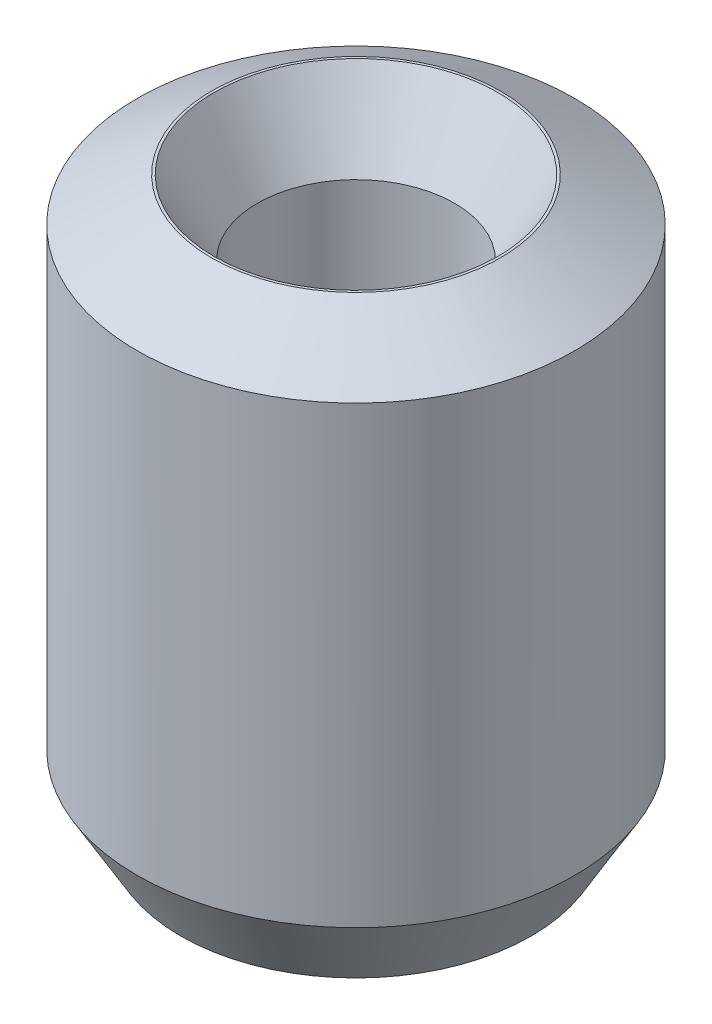
ISO-10303-21;
HEADER;
FILE_DESCRIPTION(('STEP AP214'),'2;1');
FILE_NAME('part.step','',(''),(''),'','','');
FILE_SCHEMA(('AUTOMOTIVE_DESIGN { 1 0 10303 214 1 1 1 1 }'));
ENDSEC;
DATA;
#1=APPLICATION_CONTEXT('core data for automotive mechanical design processes');
#2=APPLICATION_PROTOCOL_DEFINITION('international standard','automotive_design',2000,#1);
#3=PRODUCT_CONTEXT('',#1,'mechanical');
#4=PRODUCT('Part','Part','',(#3));
#5=PRODUCT_RELATED_PRODUCT_CATEGORY('part','',(#4));
#6=PRODUCT_DEFINITION_FORMATION('','',#4);
#7=PRODUCT_DEFINITION_CONTEXT('part definition',#1,'design');
#8=PRODUCT_DEFINITION('design','',#6,#7);
#9=PRODUCT_DEFINITION_SHAPE('','',#8);
#10=(LENGTH_UNIT() NAMED_UNIT(*) SI_UNIT(.MILLI.,.METRE.));
#11=(NAMED_UNIT(*) PLANE_ANGLE_UNIT() SI_UNIT($,.RADIAN.));
#12=(NAMED_UNIT(*) SI_UNIT($,.STERADIAN.) SOLID_ANGLE_UNIT());
#13=UNCERTAINTY_MEASURE_WITH_UNIT(LENGTH_MEASURE(1.E-05),#10,'distance_accuracy_value','');
#14=(GEOMETRIC_REPRESENTATION_CONTEXT(3) GLOBAL_UNCERTAINTY_ASSIGNED_CONTEXT((#13)) GLOBAL_UNIT_ASSIGNED_CONTEXT((#10,
#11,#12)) REPRESENTATION_CONTEXT('',''));
#15=CARTESIAN_POINT('',(0.,0.,0.));
#16=DIRECTION('',(0.,0.,1.));
#17=DIRECTION('',(1.,0.,0.));
#18=AXIS2_PLACEMENT_3D('',#15,#16,#17);
#19=CARTESIAN_POINT('',(0.,52.3049852284632,0.));
#20=DIRECTION('',(0.,-1.,0.));
#21=DIRECTION('',(0.,0.,-1.));
#22=AXIS2_PLACEMENT_3D('',#19,#20,#21);
#23=CYLINDRICAL_SURFACE('',#22,20.);
#24=CARTESIAN_POINT('',(0.,6.78475319766107,0.));
#25=DIRECTION('',(0.,1.,0.));
#26=DIRECTION('',(0.,0.,1.));
#27=AXIS2_PLACEMENT_3D('',#24,#25,#26);
#28=CIRCLE('',#27,20.);
#29=CARTESIAN_POINT('',(0.,6.78475319766107,-20.));
#30=VERTEX_POINT('',#29);
#31=EDGE_CURVE('E10',#30,#30,#28,.T.);
#32=CARTESIAN_POINT('',(0.,48.3359332587798,0.));
#33=DIRECTION('',(0.,1.,0.));
#34=DIRECTION('',(0.,0.,1.));
#35=AXIS2_PLACEMENT_3D('',#32,#33,#34);
#36=CIRCLE('',#35,20.);
#37=CARTESIAN_POINT('',(0.,48.3359332587798,-20.));
#38=VERTEX_POINT('',#37);
#39=EDGE_CURVE('E50',#38,#38,#36,.F.);
#40=CARTESIAN_POINT('',(0.,6.78475319766107,-20.));
#41=CARTESIAN_POINT('',(0.,7.21757798996439,-20.));
#42=CARTESIAN_POINT('',(0.,7.65040278226771,-20.));
#43=CARTESIAN_POINT('',(0.,8.51605236687435,-20.));
#44=CARTESIAN_POINT('',(0.,8.94887715917767,-20.));
#45=CARTESIAN_POINT('',(0.,9.81452674378431,-20.));
#46=CARTESIAN_POINT('',(0.,10.2473515360876,-20.));
#47=CARTESIAN_POINT('',(0.,11.1130011206943,-20.));
#48=CARTESIAN_POINT('',(0.,11.5458259129976,-20.));
#49=CARTESIAN_POINT('',(0.,12.4114754976042,-20.));
#50=CARTESIAN_POINT('',(0.,12.8443002899076,-20.));
#51=CARTESIAN_POINT('',(0.,13.7099498745142,-20.));
#52=CARTESIAN_POINT('',(0.,14.1427746668175,-20.));
#53=CARTESIAN_POINT('',(0.,15.0084242514241,-20.));
#54=CARTESIAN_POINT('',(0.,15.4412490437275,-20.));
#55=CARTESIAN_POINT('',(0.,16.3068986283341,-20.));
#56=CARTESIAN_POINT('',(0.,16.7397234206374,-20.));
#57=CARTESIAN_POINT('',(0.,17.6053730052441,-20.));
#58=CARTESIAN_POINT('',(0.,18.0381977975474,-20.));
#59=CARTESIAN_POINT('',(0.,18.903847382154,-20.));
#60=CARTESIAN_POINT('',(0.,19.3366721744573,-20.));
#61=CARTESIAN_POINT('',(0.,20.202321759064,-20.));
#62=CARTESIAN_POINT('',(0.,20.6351465513673,-20.));
#63=CARTESIAN_POINT('',(0.,21.5007961359739,-20.));
#64=CARTESIAN_POINT('',(0.,21.9336209282773,-20.));
#65=CARTESIAN_POINT('',(0.,22.7992705128839,-20.));
#66=CARTESIAN_POINT('',(0.,23.2320953051872,-20.));
#67=CARTESIAN_POINT('',(0.,24.0977448897939,-20.));
#68=CARTESIAN_POINT('',(0.,24.5305696820972,-20.));
#69=CARTESIAN_POINT('',(0.,25.3962192667038,-20.));
#70=CARTESIAN_POINT('',(0.,25.8290440590071,-20.));
#71=CARTESIAN_POINT('',(0.,26.6946936436138,-20.));
#72=CARTESIAN_POINT('',(0.,27.1275184359171,-20.));
#73=CARTESIAN_POINT('',(0.,27.9931680205237,-20.));
#74=CARTESIAN_POINT('',(0.,28.4259928128271,-20.));
#75=CARTESIAN_POINT('',(0.,29.2916423974337,-20.));
#76=CARTESIAN_POINT('',(0.,29.724467189737,-20.));
#77=CARTESIAN_POINT('',(0.,30.5901167743437,-20.));
#78=CARTESIAN_POINT('',(0.,31.022941566647,-20.));
#79=CARTESIAN_POINT('',(0.,31.8885911512536,-20.));
#80=CARTESIAN_POINT('',(0.,32.3214159435569,-20.));
#81=CARTESIAN_POINT('',(0.,33.1870655281636,-20.));
#82=CARTESIAN_POINT('',(0.,33.6198903204669,-20.));
#83=CARTESIAN_POINT('',(0.,34.4855399050735,-20.));
#84=CARTESIAN_POINT('',(0.,34.9183646973769,-20.));
#85=CARTESIAN_POINT('',(0.,35.7840142819835,-20.));
#86=CARTESIAN_POINT('',(0.,36.2168390742868,-20.));
#87=CARTESIAN_POINT('',(0.,37.0824886588935,-20.));
#88=CARTESIAN_POINT('',(0.,37.5153134511968,-20.));
#89=CARTESIAN_POINT('',(0.,38.3809630358034,-20.));
#90=CARTESIAN_POINT('',(0.,38.8137878281067,-20.));
#91=CARTESIAN_POINT('',(0.,39.6794374127134,-20.));
#92=CARTESIAN_POINT('',(0.,40.1122622050167,-20.));
#93=CARTESIAN_POINT('',(0.,40.9779117896233,-20.));
#94=CARTESIAN_POINT('',(0.,41.4107365819266,-20.));
#95=CARTESIAN_POINT('',(0.,42.2763861665333,-20.));
#96=CARTESIAN_POINT('',(0.,42.7092109588366,-20.));
#97=CARTESIAN_POINT('',(0.,43.5748605434433,-20.));
#98=CARTESIAN_POINT('',(0.,44.0076853357466,-20.));
#99=CARTESIAN_POINT('',(0.,44.8733349203532,-20.));
#100=CARTESIAN_POINT('',(0.,45.3061597126565,-20.));
#101=CARTESIAN_POINT('',(0.,46.1718092972632,-20.));
#102=CARTESIAN_POINT('',(0.,46.6046340895665,-20.));
#103=CARTESIAN_POINT('',(0.,47.4702836741731,-20.));
#104=CARTESIAN_POINT('',(0.,47.9031084664764,-20.));
#105=CARTESIAN_POINT('',(0.,48.3359332587798,-20.));
#106=B_SPLINE_CURVE_WITH_KNOTS('',3,(#40,#41,#42,#43,#44,#45,#46,#47,#48,#49,#50,#51,#52,#53,
#54,#55,#56,#57,#58,#59,#60,#61,#62,#63,#64,#65,#66,#67,#68,#69,#70,#71,#72,#73,#74,#75,#76,#77,
#78,#79,#80,#81,#82,#83,#84,#85,#86,#87,#88,#89,#90,#91,#92,#93,#94,#95,#96,#97,#98,#99,#100,
#101,#102,#103,#104,#105),.UNSPECIFIED.,.F.,.F.,(4,2,2,2,2,2,2,2,2,2,2,2,2,2,2,2,2,2,2,2,2,2,2,
2,2,2,2,2,2,2,2,2,4),(0.,1.29847437690996,2.59694875381992,3.89542313072988,5.19389750763984,
6.4923718845498,7.79084626145975,9.08932063836972,10.3877950152797,11.6862693921896,
12.9847437690996,14.2832181460095,15.5816925229195,16.8801668998295,18.1786412767394,
19.4771156536494,20.7755900305593,22.0740644074693,23.3725387843793,24.6710131612892,
25.9694875381992,27.2679619151091,28.5664362920191,29.8649106689291,31.163385045839,
32.461859422749,33.7603337996589,35.0588081765689,36.3572825534789,37.6557569303888,
38.9542313072988,40.2527056842087,41.5511800611187),.UNSPECIFIED.);
#107=EDGE_CURVE('BSEAM39',#30,#38,#106,.T.);
#108=ORIENTED_EDGE('',*,*,#31,.T.);
#109=ORIENTED_EDGE('',*,*,#39,.T.);
#110=ORIENTED_EDGE('',*,*,#107,.T.);
#111=ORIENTED_EDGE('',*,*,#107,.F.);
#112=EDGE_LOOP('',(#108,#110,#109,#111));
#113=FACE_BOUND('',#112,.T.);
#114=ADVANCED_FACE('F39',(#113),#23,.T.);
#115=CARTESIAN_POINT('',(0.,52.3049852284632,0.));
#116=DIRECTION('',(0.,1.,0.));
#117=DIRECTION('',(0.,0.,1.));
#118=AXIS2_PLACEMENT_3D('',#115,#116,#117);
#119=PLANE('',#118);
#120=CARTESIAN_POINT('',(0.,52.3049852284632,0.));
#121=DIRECTION('',(0.,1.,0.));
#122=DIRECTION('',(0.,0.,1.));
#123=AXIS2_PLACEMENT_3D('',#120,#121,#122);
#124=CIRCLE('',#123,12.9840411792819);
#125=CARTESIAN_POINT('',(0.,52.3049852284632,12.9840411792819));
#126=VERTEX_POINT('',#125);
#127=EDGE_CURVE('E58',#126,#126,#124,.F.);
#128=ORIENTED_EDGE('',*,*,#127,.T.);
#129=EDGE_LOOP('',(#128));
#130=FACE_BOUND('',#129,.T.);
#131=CARTESIAN_POINT('',(0.,52.3049852284632,0.));
#132=DIRECTION('',(0.,1.,0.));
#133=DIRECTION('',(0.,0.,1.));
#134=AXIS2_PLACEMENT_3D('',#131,#132,#133);
#135=CIRCLE('',#134,13.215246802339);
#136=CARTESIAN_POINT('',(0.,52.3049852284632,13.215246802339));
#137=VERTEX_POINT('',#136);
#138=EDGE_CURVE('E61',#137,#137,#135,.T.);
#139=ORIENTED_EDGE('',*,*,#138,.T.);
#140=EDGE_LOOP('',(#139));
#141=FACE_BOUND('',#140,.T.);
#142=ADVANCED_FACE('F88',(#130,#141),#119,.T.);
#143=CARTESIAN_POINT('',(0.,0.,0.));
#144=DIRECTION('',(0.,1.,0.));
#145=DIRECTION('',(0.,0.,1.));
#146=AXIS2_PLACEMENT_3D('',#143,#144,#145);
#147=PLANE('',#146);
#148=CARTESIAN_POINT('',(0.,0.,0.));
#149=DIRECTION('',(0.,1.,0.));
#150=DIRECTION('',(0.,0.,1.));
#151=AXIS2_PLACEMENT_3D('',#148,#149,#150);
#152=CIRCLE('',#151,15.7997424072594);
#153=CARTESIAN_POINT('',(0.,0.,15.7997424072594));
#154=VERTEX_POINT('',#153);
#155=EDGE_CURVE('E51',#154,#154,#152,.T.);
#156=ORIENTED_EDGE('',*,*,#155,.T.);
#157=EDGE_LOOP('',(#156));
#158=FACE_BOUND('',#157,.T.);
#159=CARTESIAN_POINT('',(0.,0.,0.));
#160=DIRECTION('',(0.,1.,0.));
#161=DIRECTION('',(0.,0.,1.));
#162=AXIS2_PLACEMENT_3D('',#159,#160,#161);
#163=CIRCLE('',#162,16.0309480303165);
#164=CARTESIAN_POINT('',(0.,0.,16.0309480303165));
#165=VERTEX_POINT('',#164);
#166=EDGE_CURVE('E54',#165,#165,#163,.F.);
#167=ORIENTED_EDGE('',*,*,#166,.T.);
#168=EDGE_LOOP('',(#167));
#169=FACE_BOUND('',#168,.T.);
#170=ADVANCED_FACE('F83',(#158,#169),#147,.F.);
#171=CARTESIAN_POINT('',(0.,52.3049852284632,0.));
#172=DIRECTION('',(0.,-1.,0.));
#173=DIRECTION('',(0.,0.,-1.));
#174=AXIS2_PLACEMENT_3D('',#171,#172,#173);
#175=CYLINDRICAL_SURFACE('',#174,9.01498920959841);
#176=CARTESIAN_POINT('',(0.,45.5202320308021,0.));
#177=DIRECTION('',(0.,1.,0.));
#178=DIRECTION('',(0.,0.,1.));
#179=AXIS2_PLACEMENT_3D('',#176,#177,#178);
#180=CIRCLE('',#179,9.01498920959841);
#181=CARTESIAN_POINT('',(0.,45.5202320308021,-9.01498920959841));
#182=VERTEX_POINT('',#181);
#183=EDGE_CURVE('E67',#182,#182,#180,.T.);
#184=CARTESIAN_POINT('',(0.,3.96905196968342,0.));
#185=DIRECTION('',(0.,1.,0.));
#186=DIRECTION('',(0.,0.,1.));
#187=AXIS2_PLACEMENT_3D('',#184,#185,#186);
#188=CIRCLE('',#187,9.01498920959841);
#189=CARTESIAN_POINT('',(0.,3.96905196968342,-9.01498920959841));
#190=VERTEX_POINT('',#189);
#191=EDGE_CURVE('E69',#190,#190,#188,.F.);
#192=CARTESIAN_POINT('',(0.,45.5202320308021,-9.01498920959841));
#193=CARTESIAN_POINT('',(0.,45.0874072384988,-9.01498920959841));
#194=CARTESIAN_POINT('',(0.,44.6545824461955,-9.01498920959841));
#195=CARTESIAN_POINT('',(0.,43.7889328615888,-9.01498920959841));
#196=CARTESIAN_POINT('',(0.,43.3561080692855,-9.01498920959841));
#197=CARTESIAN_POINT('',(0.,42.4904584846789,-9.01498920959841));
#198=CARTESIAN_POINT('',(0.,42.0576336923755,-9.01498920959841));
#199=CARTESIAN_POINT('',(0.,41.1919841077689,-9.01498920959841));
#200=CARTESIAN_POINT('',(0.,40.7591593154656,-9.01498920959841));
#201=CARTESIAN_POINT('',(0.,39.893509730859,-9.01498920959841));
#202=CARTESIAN_POINT('',(0.,39.4606849385556,-9.01498920959841));
#203=CARTESIAN_POINT('',(0.,38.595035353949,-9.01498920959841));
#204=CARTESIAN_POINT('',(0.,38.1622105616457,-9.01498920959841));
#205=CARTESIAN_POINT('',(0.,37.296560977039,-9.01498920959841));
#206=CARTESIAN_POINT('',(0.,36.8637361847357,-9.01498920959841));
#207=CARTESIAN_POINT('',(0.,35.9980866001291,-9.01498920959841));
#208=CARTESIAN_POINT('',(0.,35.5652618078257,-9.01498920959841));
#209=CARTESIAN_POINT('',(0.,34.6996122232191,-9.01498920959841));
#210=CARTESIAN_POINT('',(0.,34.2667874309158,-9.01498920959841));
#211=CARTESIAN_POINT('',(0.,33.4011378463092,-9.01498920959841));
#212=CARTESIAN_POINT('',(0.,32.9683130540058,-9.01498920959841));
#213=CARTESIAN_POINT('',(0.,32.1026634693992,-9.01498920959841));
#214=CARTESIAN_POINT('',(0.,31.6698386770959,-9.01498920959841));
#215=CARTESIAN_POINT('',(0.,30.8041890924892,-9.01498920959841));
#216=CARTESIAN_POINT('',(0.,30.3713643001859,-9.01498920959841));
#217=CARTESIAN_POINT('',(0.,29.5057147155793,-9.01498920959841));
#218=CARTESIAN_POINT('',(0.,29.072889923276,-9.01498920959841));
#219=CARTESIAN_POINT('',(0.,28.2072403386693,-9.01498920959841));
#220=CARTESIAN_POINT('',(0.,27.774415546366,-9.01498920959841));
#221=CARTESIAN_POINT('',(0.,26.9087659617594,-9.01498920959841));
#222=CARTESIAN_POINT('',(0.,26.475941169456,-9.01498920959841));
#223=CARTESIAN_POINT('',(0.,25.6102915848494,-9.01498920959841));
#224=CARTESIAN_POINT('',(0.,25.1774667925461,-9.01498920959841));
#225=CARTESIAN_POINT('',(0.,24.3118172079394,-9.01498920959841));
#226=CARTESIAN_POINT('',(0.,23.8789924156361,-9.01498920959841));
#227=CARTESIAN_POINT('',(0.,23.0133428310295,-9.01498920959841));
#228=CARTESIAN_POINT('',(0.,22.5805180387262,-9.01498920959841));
#229=CARTESIAN_POINT('',(0.,21.7148684541195,-9.01498920959841));
#230=CARTESIAN_POINT('',(0.,21.2820436618162,-9.01498920959841));
#231=CARTESIAN_POINT('',(0.,20.4163940772096,-9.01498920959841));
#232=CARTESIAN_POINT('',(0.,19.9835692849062,-9.01498920959841));
#233=CARTESIAN_POINT('',(0.,19.1179197002996,-9.01498920959841));
#234=CARTESIAN_POINT('',(0.,18.6850949079963,-9.01498920959841));
#235=CARTESIAN_POINT('',(0.,17.8194453233896,-9.01498920959841));
#236=CARTESIAN_POINT('',(0.,17.3866205310863,-9.01498920959841));
#237=CARTESIAN_POINT('',(0.,16.5209709464797,-9.01498920959841));
#238=CARTESIAN_POINT('',(0.,16.0881461541764,-9.01498920959841));
#239=CARTESIAN_POINT('',(0.,15.2224965695697,-9.01498920959841));
#240=CARTESIAN_POINT('',(0.,14.7896717772664,-9.01498920959841));
#241=CARTESIAN_POINT('',(0.,13.9240221926598,-9.01498920959841));
#242=CARTESIAN_POINT('',(0.,13.4911974003565,-9.01498920959841));
#243=CARTESIAN_POINT('',(0.,12.6255478157498,-9.01498920959841));
#244=CARTESIAN_POINT('',(0.,12.1927230234465,-9.01498920959841));
#245=CARTESIAN_POINT('',(0.,11.3270734388398,-9.01498920959841));
#246=CARTESIAN_POINT('',(0.,10.8942486465365,-9.01498920959841));
#247=CARTESIAN_POINT('',(0.,10.0285990619299,-9.01498920959841));
#248=CARTESIAN_POINT('',(0.,9.59577426962657,-9.01498920959841));
#249=CARTESIAN_POINT('',(0.,8.73012468501994,-9.01498920959841));
#250=CARTESIAN_POINT('',(0.,8.29729989271662,-9.01498920959841));
#251=CARTESIAN_POINT('',(0.,7.43165030810998,-9.01498920959841));
#252=CARTESIAN_POINT('',(0.,6.99882551580665,-9.01498920959841));
#253=CARTESIAN_POINT('',(0.,6.13317593120001,-9.01498920959841));
#254=CARTESIAN_POINT('',(0.,5.70035113889669,-9.01498920959841));
#255=CARTESIAN_POINT('',(0.,4.83470155429005,-9.01498920959841));
#256=CARTESIAN_POINT('',(0.,4.40187676198674,-9.01498920959841));
#257=CARTESIAN_POINT('',(0.,3.96905196968342,-9.01498920959841));
#258=B_SPLINE_CURVE_WITH_KNOTS('',3,(#192,#193,#194,#195,#196,#197,#198,#199,#200,#201,#202,
#203,#204,#205,#206,#207,#208,#209,#210,#211,#212,#213,#214,#215,#216,#217,#218,#219,#220,#221,
#222,#223,#224,#225,#226,#227,#228,#229,#230,#231,#232,#233,#234,#235,#236,#237,#238,#239,#240,
#241,#242,#243,#244,#245,#246,#247,#248,#249,#250,#251,#252,#253,#254,#255,#256,#257),
.UNSPECIFIED.,.F.,.F.,(4,2,2,2,2,2,2,2,2,2,2,2,2,2,2,2,2,2,2,2,2,2,2,2,2,2,2,2,2,2,2,2,4),(0.,
1.29847437690996,2.59694875381992,3.89542313072988,5.19389750763984,6.4923718845498,
7.79084626145976,9.08932063836972,10.3877950152797,11.6862693921896,12.9847437690996,
14.2832181460096,15.5816925229195,16.8801668998295,18.1786412767394,19.4771156536494,
20.7755900305593,22.0740644074693,23.3725387843793,24.6710131612892,25.9694875381992,
27.2679619151091,28.5664362920191,29.8649106689291,31.163385045839,32.461859422749,
33.7603337996589,35.0588081765689,36.3572825534789,37.6557569303888,38.9542313072988,
40.2527056842087,41.5511800611187),.UNSPECIFIED.);
#259=EDGE_CURVE('BSEAM71',#182,#190,#258,.T.);
#260=ORIENTED_EDGE('',*,*,#183,.T.);
#261=ORIENTED_EDGE('',*,*,#191,.T.);
#262=ORIENTED_EDGE('',*,*,#259,.T.);
#263=ORIENTED_EDGE('',*,*,#259,.F.);
#264=EDGE_LOOP('',(#260,#262,#261,#263));
#265=FACE_BOUND('',#264,.T.);
#266=ADVANCED_FACE('F71',(#265),#175,.F.);
#267=CARTESIAN_POINT('',(0.,45.5202320308021,0.));
#268=DIRECTION('',(0.,1.,0.));
#269=DIRECTION('',(0.,0.,1.));
#270=AXIS2_PLACEMENT_3D('',#267,#268,#269);
#271=CONICAL_SURFACE('',#270,9.01498920959841,0.529313923561836);
#272=ORIENTED_EDGE('',*,*,#127,.F.);
#273=EDGE_LOOP('',(#272));
#274=FACE_BOUND('',#273,.T.);
#275=ORIENTED_EDGE('',*,*,#183,.F.);
#276=EDGE_LOOP('',(#275));
#277=FACE_BOUND('',#276,.T.);
#278=ADVANCED_FACE('F77',(#274,#277),#271,.F.);
#279=CARTESIAN_POINT('',(0.,0.,0.));
#280=DIRECTION('',(0.,-1.,0.));
#281=DIRECTION('',(0.,0.,-1.));
#282=AXIS2_PLACEMENT_3D('',#279,#280,#281);
#283=CONICAL_SURFACE('',#282,15.7997424072594,1.04148240323306);
#284=ORIENTED_EDGE('',*,*,#191,.F.);
#285=EDGE_LOOP('',(#284));
#286=FACE_BOUND('',#285,.T.);
#287=ORIENTED_EDGE('',*,*,#155,.F.);
#288=EDGE_LOOP('',(#287));
#289=FACE_BOUND('',#288,.T.);
#290=ADVANCED_FACE('F73',(#286,#289),#283,.F.);
#291=CARTESIAN_POINT('',(0.,6.78475319766107,0.));
#292=DIRECTION('',(0.,1.,0.));
#293=DIRECTION('',(0.,0.,1.));
#294=AXIS2_PLACEMENT_3D('',#291,#292,#293);
#295=CONICAL_SURFACE('',#294,20.,0.529313923561836);
#296=ORIENTED_EDGE('',*,*,#166,.F.);
#297=EDGE_LOOP('',(#296));
#298=FACE_BOUND('',#297,.T.);
#299=ORIENTED_EDGE('',*,*,#31,.F.);
#300=EDGE_LOOP('',(#299));
#301=FACE_BOUND('',#300,.T.);
#302=ADVANCED_FACE('F76',(#298,#301),#295,.T.);
#303=CARTESIAN_POINT('',(0.,52.3049852284632,0.));
#304=DIRECTION('',(0.,-1.,0.));
#305=DIRECTION('',(0.,0.,-1.));
#306=AXIS2_PLACEMENT_3D('',#303,#304,#305);
#307=CONICAL_SURFACE('',#306,13.215246802339,1.04148240323306);
#308=ORIENTED_EDGE('',*,*,#39,.F.);
#309=EDGE_LOOP('',(#308));
#310=FACE_BOUND('',#309,.T.);
#311=ORIENTED_EDGE('',*,*,#138,.F.);
#312=EDGE_LOOP('',(#311));
#313=FACE_BOUND('',#312,.T.);
#314=ADVANCED_FACE('F45',(#310,#313),#307,.T.);
#315=CLOSED_SHELL('',(#114,#142,#170,#266,#278,#290,#302,#314));
#316=MANIFOLD_SOLID_BREP('B2',#315);
#317=ADVANCED_BREP_SHAPE_REPRESENTATION('',(#18,#316),#14);
#318=SHAPE_DEFINITION_REPRESENTATION(#9,#317);
ENDSEC;
END-ISO-10303-21;
